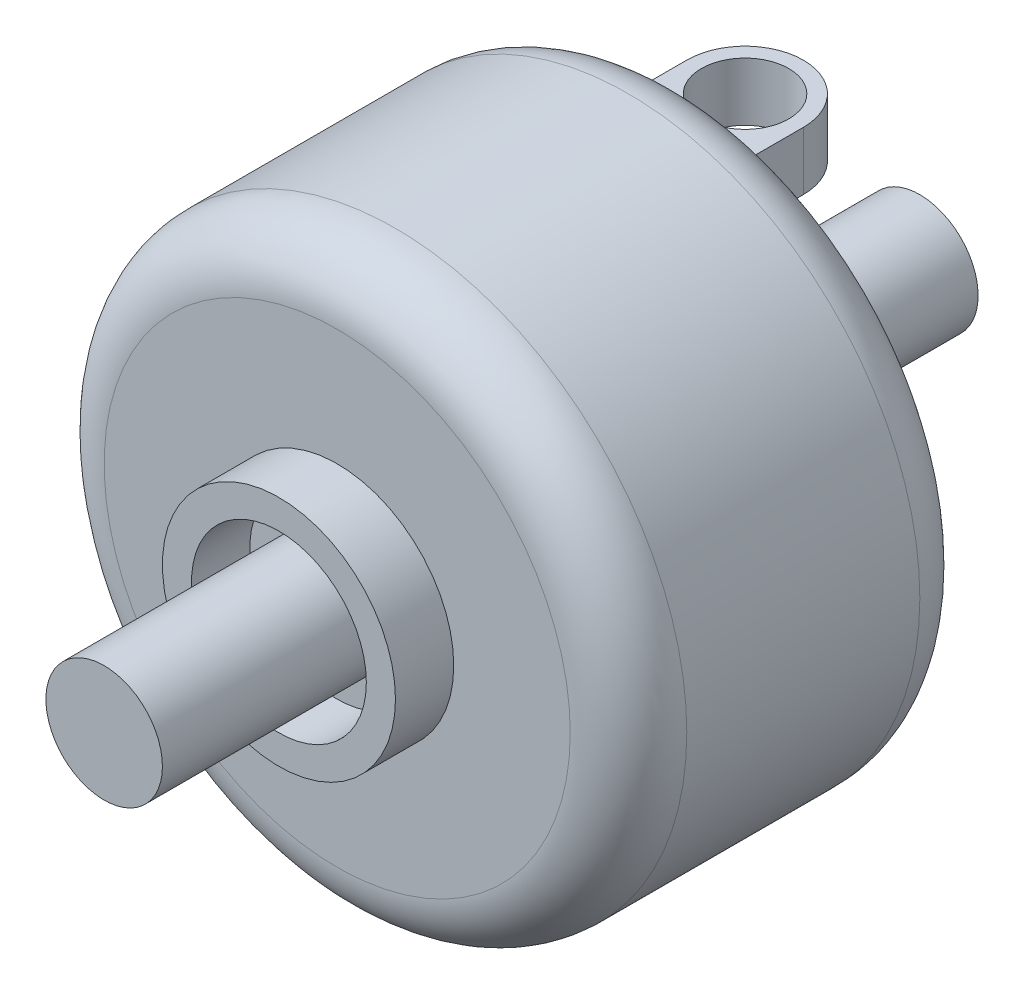
ISO-10303-21;
HEADER;
FILE_DESCRIPTION(('STEP AP214'),'2;1');
FILE_NAME('part.step','',(''),(''),'','','');
FILE_SCHEMA(('AUTOMOTIVE_DESIGN { 1 0 10303 214 1 1 1 1 }'));
ENDSEC;
DATA;
#1=APPLICATION_CONTEXT('core data for automotive mechanical design processes');
#2=APPLICATION_PROTOCOL_DEFINITION('international standard','automotive_design',2000,#1);
#3=PRODUCT_CONTEXT('',#1,'mechanical');
#4=PRODUCT('Part','Part','',(#3));
#5=PRODUCT_RELATED_PRODUCT_CATEGORY('part','',(#4));
#6=PRODUCT_DEFINITION_FORMATION('','',#4);
#7=PRODUCT_DEFINITION_CONTEXT('part definition',#1,'design');
#8=PRODUCT_DEFINITION('design','',#6,#7);
#9=PRODUCT_DEFINITION_SHAPE('','',#8);
#10=(LENGTH_UNIT() NAMED_UNIT(*) SI_UNIT(.MILLI.,.METRE.));
#11=(NAMED_UNIT(*) PLANE_ANGLE_UNIT() SI_UNIT($,.RADIAN.));
#12=(NAMED_UNIT(*) SI_UNIT($,.STERADIAN.) SOLID_ANGLE_UNIT());
#13=UNCERTAINTY_MEASURE_WITH_UNIT(LENGTH_MEASURE(1.E-05),#10,'distance_accuracy_value','');
#14=(GEOMETRIC_REPRESENTATION_CONTEXT(3) GLOBAL_UNCERTAINTY_ASSIGNED_CONTEXT((#13)) GLOBAL_UNIT_ASSIGNED_CONTEXT((#10,
#11,#12)) REPRESENTATION_CONTEXT('',''));
#15=CARTESIAN_POINT('',(0.,0.,0.));
#16=DIRECTION('',(0.,0.,1.));
#17=DIRECTION('',(1.,0.,0.));
#18=AXIS2_PLACEMENT_3D('',#15,#16,#17);
#19=CARTESIAN_POINT('',(0.,0.,50.));
#20=DIRECTION('',(0.,0.,-1.));
#21=DIRECTION('',(-1.,0.,0.));
#22=AXIS2_PLACEMENT_3D('',#19,#20,#21);
#23=CYLINDRICAL_SURFACE('',#22,10.);
#24=CARTESIAN_POINT('',(0.,0.,30.));
#25=DIRECTION('',(0.,0.,1.));
#26=DIRECTION('',(1.,0.,0.));
#27=AXIS2_PLACEMENT_3D('',#24,#25,#26);
#28=CIRCLE('',#27,10.);
#29=CARTESIAN_POINT('',(10.,0.,30.));
#30=VERTEX_POINT('',#29);
#31=EDGE_CURVE('E187',#30,#30,#28,.T.);
#32=ORIENTED_EDGE('',*,*,#31,.T.);
#33=EDGE_LOOP('',(#32));
#34=FACE_BOUND('',#33,.T.);
#35=CARTESIAN_POINT('',(0.,0.,35.));
#36=DIRECTION('',(0.,0.,1.));
#37=DIRECTION('',(1.,0.,0.));
#38=AXIS2_PLACEMENT_3D('',#35,#36,#37);
#39=CIRCLE('',#38,10.);
#40=CARTESIAN_POINT('',(10.,0.,35.));
#41=VERTEX_POINT('',#40);
#42=EDGE_CURVE('E421',#41,#41,#39,.T.);
#43=ORIENTED_EDGE('',*,*,#42,.F.);
#44=EDGE_LOOP('',(#43));
#45=FACE_BOUND('',#44,.T.);
#46=ADVANCED_FACE('F41',(#34,#45),#23,.T.);
#47=CARTESIAN_POINT('',(0.,0.,0.));
#48=DIRECTION('',(0.,0.,1.));
#49=DIRECTION('',(1.,0.,0.));
#50=AXIS2_PLACEMENT_3D('',#47,#48,#49);
#51=PLANE('',#50);
#52=DIRECTION('',(0.,1.,0.));
#53=VECTOR('',#52,1.);
#54=CARTESIAN_POINT('',(-5.,-20.,0.));
#55=LINE('',#54,#53);
#56=CARTESIAN_POINT('',(-5.,-19.3649167310371,0.));
#57=VERTEX_POINT('',#56);
#58=CARTESIAN_POINT('',(-5.,-15.,0.));
#59=VERTEX_POINT('',#58);
#60=EDGE_CURVE('E441',#57,#59,#55,.T.);
#61=ORIENTED_EDGE('',*,*,#60,.F.);
#62=CARTESIAN_POINT('',(0.,0.,0.));
#63=DIRECTION('',(0.,0.,1.));
#64=DIRECTION('',(1.,0.,0.));
#65=AXIS2_PLACEMENT_3D('',#62,#63,#64);
#66=CIRCLE('',#65,20.);
#67=CARTESIAN_POINT('',(-5.,19.3649167310371,0.));
#68=VERTEX_POINT('',#67);
#69=EDGE_CURVE('E156',#57,#68,#66,.F.);
#70=ORIENTED_EDGE('',*,*,#69,.T.);
#71=DIRECTION('',(0.,1.,0.));
#72=VECTOR('',#71,1.);
#73=CARTESIAN_POINT('',(-5.,15.,0.));
#74=LINE('',#73,#72);
#75=CARTESIAN_POINT('',(-5.,15.,0.));
#76=VERTEX_POINT('',#75);
#77=EDGE_CURVE('E139',#76,#68,#74,.T.);
#78=ORIENTED_EDGE('',*,*,#77,.F.);
#79=DIRECTION('',(-1.,0.,0.));
#80=VECTOR('',#79,1.);
#81=CARTESIAN_POINT('',(-5.,15.,0.));
#82=LINE('',#81,#80);
#83=CARTESIAN_POINT('',(5.,15.,0.));
#84=VERTEX_POINT('',#83);
#85=EDGE_CURVE('E146',#84,#76,#82,.T.);
#86=ORIENTED_EDGE('',*,*,#85,.F.);
#87=DIRECTION('',(0.,-1.,0.));
#88=VECTOR('',#87,1.);
#89=CARTESIAN_POINT('',(5.,15.,0.));
#90=LINE('',#89,#88);
#91=CARTESIAN_POINT('',(5.,19.3649167310371,0.));
#92=VERTEX_POINT('',#91);
#93=EDGE_CURVE('E158',#92,#84,#90,.T.);
#94=ORIENTED_EDGE('',*,*,#93,.F.);
#95=CARTESIAN_POINT('',(0.,0.,0.));
#96=DIRECTION('',(0.,0.,1.));
#97=DIRECTION('',(1.,0.,0.));
#98=AXIS2_PLACEMENT_3D('',#95,#96,#97);
#99=CIRCLE('',#98,20.);
#100=CARTESIAN_POINT('',(5.,-19.3649167310371,0.));
#101=VERTEX_POINT('',#100);
#102=EDGE_CURVE('E213',#92,#101,#99,.F.);
#103=ORIENTED_EDGE('',*,*,#102,.T.);
#104=DIRECTION('',(0.,-1.,0.));
#105=VECTOR('',#104,1.);
#106=CARTESIAN_POINT('',(5.,-20.,0.));
#107=LINE('',#106,#105);
#108=CARTESIAN_POINT('',(5.,-15.,0.));
#109=VERTEX_POINT('',#108);
#110=EDGE_CURVE('E449',#109,#101,#107,.T.);
#111=ORIENTED_EDGE('',*,*,#110,.F.);
#112=DIRECTION('',(1.,0.,0.));
#113=VECTOR('',#112,1.);
#114=CARTESIAN_POINT('',(-5.,-15.,0.));
#115=LINE('',#114,#113);
#116=EDGE_CURVE('E445',#59,#109,#115,.T.);
#117=ORIENTED_EDGE('',*,*,#116,.F.);
#118=EDGE_LOOP('',(#61,#70,#78,#86,#94,#103,#111,#117));
#119=FACE_BOUND('',#118,.T.);
#120=CARTESIAN_POINT('',(0.,0.,0.));
#121=DIRECTION('',(0.,0.,-1.));
#122=DIRECTION('',(-1.,0.,0.));
#123=AXIS2_PLACEMENT_3D('',#120,#121,#122);
#124=CIRCLE('',#123,10.);
#125=CARTESIAN_POINT('',(-10.,0.,0.));
#126=VERTEX_POINT('',#125);
#127=EDGE_CURVE('E182',#126,#126,#124,.T.);
#128=ORIENTED_EDGE('',*,*,#127,.F.);
#129=EDGE_LOOP('',(#128));
#130=FACE_BOUND('',#129,.T.);
#131=ADVANCED_FACE('F152',(#119,#130),#51,.F.);
#132=CARTESIAN_POINT('',(0.,0.,30.));
#133=DIRECTION('',(0.,0.,-1.));
#134=DIRECTION('',(-1.,0.,0.));
#135=AXIS2_PLACEMENT_3D('',#132,#133,#134);
#136=CYLINDRICAL_SURFACE('',#135,25.);
#137=CARTESIAN_POINT('',(0.,0.,25.));
#138=DIRECTION('',(0.,0.,1.));
#139=DIRECTION('',(1.,0.,0.));
#140=AXIS2_PLACEMENT_3D('',#137,#138,#139);
#141=CIRCLE('',#140,25.);
#142=CARTESIAN_POINT('',(25.,0.,25.));
#143=VERTEX_POINT('',#142);
#144=EDGE_CURVE('E209',#143,#143,#141,.F.);
#145=ORIENTED_EDGE('',*,*,#144,.T.);
#146=EDGE_LOOP('',(#145));
#147=FACE_BOUND('',#146,.T.);
#148=CARTESIAN_POINT('',(0.,0.,5.));
#149=DIRECTION('',(0.,0.,1.));
#150=DIRECTION('',(1.,0.,0.));
#151=AXIS2_PLACEMENT_3D('',#148,#149,#150);
#152=CIRCLE('',#151,25.);
#153=CARTESIAN_POINT('',(25.,0.,5.));
#154=VERTEX_POINT('',#153);
#155=EDGE_CURVE('E205',#154,#154,#152,.T.);
#156=ORIENTED_EDGE('',*,*,#155,.T.);
#157=EDGE_LOOP('',(#156));
#158=FACE_BOUND('',#157,.T.);
#159=ADVANCED_FACE('F339',(#147,#158),#136,.T.);
#160=CARTESIAN_POINT('',(0.,0.,30.));
#161=DIRECTION('',(0.,0.,1.));
#162=DIRECTION('',(1.,0.,0.));
#163=AXIS2_PLACEMENT_3D('',#160,#161,#162);
#164=PLANE('',#163);
#165=CARTESIAN_POINT('',(0.,0.,30.));
#166=DIRECTION('',(0.,0.,1.));
#167=DIRECTION('',(1.,0.,0.));
#168=AXIS2_PLACEMENT_3D('',#165,#166,#167);
#169=CIRCLE('',#168,20.);
#170=CARTESIAN_POINT('',(20.,0.,30.));
#171=VERTEX_POINT('',#170);
#172=EDGE_CURVE('E186',#171,#171,#169,.T.);
#173=ORIENTED_EDGE('',*,*,#172,.T.);
#174=EDGE_LOOP('',(#173));
#175=FACE_BOUND('',#174,.T.);
#176=ORIENTED_EDGE('',*,*,#31,.F.);
#177=EDGE_LOOP('',(#176));
#178=FACE_BOUND('',#177,.T.);
#179=ADVANCED_FACE('F346',(#175,#178),#164,.T.);
#180=CARTESIAN_POINT('',(0.,0.,-5.));
#181=DIRECTION('',(0.,0.,1.));
#182=DIRECTION('',(1.,0.,0.));
#183=AXIS2_PLACEMENT_3D('',#180,#181,#182);
#184=CYLINDRICAL_SURFACE('',#183,10.);
#185=CARTESIAN_POINT('',(0.,0.,-5.));
#186=DIRECTION('',(0.,0.,-1.));
#187=DIRECTION('',(-1.,0.,0.));
#188=AXIS2_PLACEMENT_3D('',#185,#186,#187);
#189=CIRCLE('',#188,10.);
#190=CARTESIAN_POINT('',(-10.,0.,-5.));
#191=VERTEX_POINT('',#190);
#192=EDGE_CURVE('E177',#191,#191,#189,.T.);
#193=ORIENTED_EDGE('',*,*,#192,.F.);
#194=EDGE_LOOP('',(#193));
#195=FACE_BOUND('',#194,.T.);
#196=ORIENTED_EDGE('',*,*,#127,.T.);
#197=EDGE_LOOP('',(#196));
#198=FACE_BOUND('',#197,.T.);
#199=ADVANCED_FACE('F348',(#195,#198),#184,.T.);
#200=CARTESIAN_POINT('',(0.,0.,-5.));
#201=DIRECTION('',(0.,0.,-1.));
#202=DIRECTION('',(-1.,0.,0.));
#203=AXIS2_PLACEMENT_3D('',#200,#201,#202);
#204=PLANE('',#203);
#205=CARTESIAN_POINT('',(0.,0.,-5.));
#206=DIRECTION('',(0.,0.,-1.));
#207=DIRECTION('',(-1.,0.,0.));
#208=AXIS2_PLACEMENT_3D('',#205,#206,#207);
#209=CIRCLE('',#208,7.5);
#210=CARTESIAN_POINT('',(-7.5,0.,-5.));
#211=VERTEX_POINT('',#210);
#212=EDGE_CURVE('E403',#211,#211,#209,.T.);
#213=ORIENTED_EDGE('',*,*,#212,.F.);
#214=EDGE_LOOP('',(#213));
#215=FACE_BOUND('',#214,.T.);
#216=ORIENTED_EDGE('',*,*,#192,.T.);
#217=EDGE_LOOP('',(#216));
#218=FACE_BOUND('',#217,.T.);
#219=ADVANCED_FACE('F331',(#215,#218),#204,.T.);
#220=CARTESIAN_POINT('',(-5.,15.,-10.));
#221=DIRECTION('',(1.,0.,0.));
#222=DIRECTION('',(0.,1.,0.));
#223=AXIS2_PLACEMENT_3D('',#220,#221,#222);
#224=PLANE('',#223);
#225=DIRECTION('',(0.,0.,1.));
#226=VECTOR('',#225,1.);
#227=CARTESIAN_POINT('',(-5.,20.,-10.));
#228=LINE('',#227,#226);
#229=CARTESIAN_POINT('',(-5.,20.,-5.));
#230=VERTEX_POINT('',#229);
#231=CARTESIAN_POINT('',(-5.,20.,0.0380321319528795));
#232=VERTEX_POINT('',#231);
#233=EDGE_CURVE('E174',#230,#232,#228,.T.);
#234=ORIENTED_EDGE('',*,*,#233,.F.);
#235=DIRECTION('',(0.,1.,0.));
#236=VECTOR('',#235,1.);
#237=CARTESIAN_POINT('',(-5.,15.,-5.));
#238=LINE('',#237,#236);
#239=CARTESIAN_POINT('',(-5.,15.,-5.));
#240=VERTEX_POINT('',#239);
#241=EDGE_CURVE('E11',#230,#240,#238,.F.);
#242=ORIENTED_EDGE('',*,*,#241,.T.);
#243=DIRECTION('',(0.,0.,1.));
#244=VECTOR('',#243,1.);
#245=CARTESIAN_POINT('',(-5.,15.,-10.));
#246=LINE('',#245,#244);
#247=EDGE_CURVE('E135',#240,#76,#246,.T.);
#248=ORIENTED_EDGE('',*,*,#247,.T.);
#249=ORIENTED_EDGE('',*,*,#77,.T.);
#250=CARTESIAN_POINT('',(-5.,19.3649167310371,0.));
#251=CARTESIAN_POINT('',(-5.,19.4711435408004,-1.59857103890314E-06));
#252=CARTESIAN_POINT('',(-5.,19.5771805060712,0.00316694102008982));
#253=CARTESIAN_POINT('',(-5.,19.788874929712,0.0158443074308182));
#254=CARTESIAN_POINT('',(-5.,19.8945323874288,0.025353145157313));
#255=CARTESIAN_POINT('',(-5.,20.,0.0380321319528704));
#256=B_SPLINE_CURVE_WITH_KNOTS('',3,(#250,#251,#252,#253,#254,#255),.UNSPECIFIED.,.F.,.F.,(4,2,
4),(0.,0.318252885019034,0.636506317513864),.UNSPECIFIED.);
#257=EDGE_CURVE('E218',#68,#232,#256,.T.);
#258=ORIENTED_EDGE('',*,*,#257,.T.);
#259=EDGE_LOOP('',(#234,#242,#248,#249,#258));
#260=FACE_BOUND('',#259,.T.);
#261=ADVANCED_FACE('F137',(#260),#224,.F.);
#262=CARTESIAN_POINT('',(-5.,20.,-10.));
#263=DIRECTION('',(0.,-1.,0.));
#264=DIRECTION('',(1.,0.,0.));
#265=AXIS2_PLACEMENT_3D('',#262,#263,#264);
#266=PLANE('',#265);
#267=CARTESIAN_POINT('',(0.,20.,-5.));
#268=DIRECTION('',(0.,1.,0.));
#269=DIRECTION('',(-1.,0.,0.));
#270=AXIS2_PLACEMENT_3D('',#267,#268,#269);
#271=CIRCLE('',#270,3.75);
#272=CARTESIAN_POINT('',(-3.74999999999999,20.,-5.));
#273=VERTEX_POINT('',#272);
#274=EDGE_CURVE('E433',#273,#273,#271,.T.);
#275=ORIENTED_EDGE('',*,*,#274,.F.);
#276=EDGE_LOOP('',(#275));
#277=FACE_BOUND('',#276,.T.);
#278=DIRECTION('',(0.,0.,1.));
#279=VECTOR('',#278,1.);
#280=CARTESIAN_POINT('',(5.,20.,-10.));
#281=LINE('',#280,#279);
#282=CARTESIAN_POINT('',(5.,20.,-5.));
#283=VERTEX_POINT('',#282);
#284=CARTESIAN_POINT('',(5.,20.,0.0380321319528778));
#285=VERTEX_POINT('',#284);
#286=EDGE_CURVE('E171',#283,#285,#281,.T.);
#287=ORIENTED_EDGE('',*,*,#286,.F.);
#288=CARTESIAN_POINT('',(0.,20.,-5.));
#289=DIRECTION('',(0.,-1.,0.));
#290=DIRECTION('',(1.,0.,0.));
#291=AXIS2_PLACEMENT_3D('',#288,#289,#290);
#292=CIRCLE('',#291,5.);
#293=CARTESIAN_POINT('',(0.,20.,-10.));
#294=VERTEX_POINT('',#293);
#295=EDGE_CURVE('E51',#283,#294,#292,.F.);
#296=ORIENTED_EDGE('',*,*,#295,.T.);
#297=CARTESIAN_POINT('',(0.,20.,-5.));
#298=DIRECTION('',(0.,-1.,0.));
#299=DIRECTION('',(1.,0.,0.));
#300=AXIS2_PLACEMENT_3D('',#297,#298,#299);
#301=CIRCLE('',#300,5.);
#302=EDGE_CURVE('E59',#294,#230,#301,.F.);
#303=ORIENTED_EDGE('',*,*,#302,.T.);
#304=ORIENTED_EDGE('',*,*,#233,.T.);
#305=CARTESIAN_POINT('',(-5.,20.,0.0380321319528789));
#306=CARTESIAN_POINT('',(-4.79172627708819,20.,0.0317770860692456));
#307=CARTESIAN_POINT('',(-4.58342331012892,20.,0.0266509781953639));
#308=CARTESIAN_POINT('',(-4.16678753030685,20.,0.0181852564625262));
#309=CARTESIAN_POINT('',(-3.95845471870868,20.,0.0148455815006976));
#310=CARTESIAN_POINT('',(-3.54178342100838,20.,0.00948110610459965));
#311=CARTESIAN_POINT('',(-3.33344493563177,20.,0.00745624395064969));
#312=CARTESIAN_POINT('',(-2.91675939888512,20.,0.00432982564868455));
#313=CARTESIAN_POINT('',(-2.70841234745178,20.,0.00322827841668376));
#314=CARTESIAN_POINT('',(-2.29173129729011,20.,0.00161848481480243));
#315=CARTESIAN_POINT('',(-2.08339729870398,20.,0.00111019566597089));
#316=CARTESIAN_POINT('',(-1.66672960605639,20.,0.000428330578891939));
#317=CARTESIAN_POINT('',(-1.45839591199652,20.,0.000254753442649956));
#318=CARTESIAN_POINT('',(-1.04171872902487,20.,4.98880398136789E-05));
#319=CARTESIAN_POINT('',(-0.833375240111585,20.,1.86064411764695E-05));
#320=CARTESIAN_POINT('',(-0.41668783052716,20.,4.61610223762926E-07));
#321=CARTESIAN_POINT('',(-0.208343909856013,20.,1.35984688042701E-05));
#322=CARTESIAN_POINT('',(0.,20.,0.));
#323=B_SPLINE_CURVE_WITH_KNOTS('',3,(#305,#306,#307,#308,#309,#310,#311,#312,#313,#314,#315,
#316,#317,#318,#319,#320,#321,#322),.UNSPECIFIED.,.F.,.F.,(4,2,2,2,2,2,2,2,4),(0.,
0.625093183831321,1.25016498570549,1.87520744346218,2.50025593688797,3.12525935621882,
3.75026053854571,4.37529100807446,5.00032275663922),.UNSPECIFIED.);
#324=CARTESIAN_POINT('',(0.,20.,0.));
#325=VERTEX_POINT('',#324);
#326=EDGE_CURVE('E227',#232,#325,#323,.T.);
#327=ORIENTED_EDGE('',*,*,#326,.T.);
#328=CARTESIAN_POINT('',(0.,20.,0.));
#329=CARTESIAN_POINT('',(0.208343909856026,20.,1.35984688049139E-05));
#330=CARTESIAN_POINT('',(0.416687830527172,20.,4.61610224618808E-07));
#331=CARTESIAN_POINT('',(0.833375240111596,20.,1.86064411769823E-05));
#332=CARTESIAN_POINT('',(1.04171872902488,20.,4.98880398136365E-05));
#333=CARTESIAN_POINT('',(1.45839591199653,20.,0.000254753442649378));
#334=CARTESIAN_POINT('',(1.6667296060564,20.,0.000428330578891381));
#335=CARTESIAN_POINT('',(2.08339729870398,20.,0.00111019566597043));
#336=CARTESIAN_POINT('',(2.29173129729012,20.,0.00161848481480206));
#337=CARTESIAN_POINT('',(2.70841234745178,20.,0.00322827841668329));
#338=CARTESIAN_POINT('',(2.91675939888512,20.,0.0043298256486839));
#339=CARTESIAN_POINT('',(3.33344493563178,20.,0.00745624395064911));
#340=CARTESIAN_POINT('',(3.54178342100838,20.,0.00948110610459933));
#341=CARTESIAN_POINT('',(3.95845471870868,20.,0.014845581500698));
#342=CARTESIAN_POINT('',(4.16678753030685,20.,0.0181852564625271));
#343=CARTESIAN_POINT('',(4.58342331012892,20.,0.0266509781953627));
#344=CARTESIAN_POINT('',(4.79172627708819,20.,0.0317770860692421));
#345=CARTESIAN_POINT('',(5.,20.,0.03803213195287));
#346=B_SPLINE_CURVE_WITH_KNOTS('',3,(#328,#329,#330,#331,#332,#333,#334,#335,#336,#337,#338,
#339,#340,#341,#342,#343,#344,#345),.UNSPECIFIED.,.F.,.F.,(4,2,2,2,2,2,2,2,4),(0.,
0.625031748564763,1.25006221809351,1.8750634004204,2.50006681975125,3.12511531317704,
3.75015777093372,4.37522957280789,5.00032275663921),.UNSPECIFIED.);
#347=EDGE_CURVE('E253',#325,#285,#346,.T.);
#348=ORIENTED_EDGE('',*,*,#347,.T.);
#349=EDGE_LOOP('',(#287,#296,#303,#304,#327,#348));
#350=FACE_BOUND('',#349,.T.);
#351=ADVANCED_FACE('F322',(#277,#350),#266,.F.);
#352=CARTESIAN_POINT('',(5.,15.,-10.));
#353=DIRECTION('',(-1.,0.,0.));
#354=DIRECTION('',(0.,-1.,0.));
#355=AXIS2_PLACEMENT_3D('',#352,#353,#354);
#356=PLANE('',#355);
#357=DIRECTION('',(0.,0.,1.));
#358=VECTOR('',#357,1.);
#359=CARTESIAN_POINT('',(5.,15.,-10.));
#360=LINE('',#359,#358);
#361=CARTESIAN_POINT('',(5.,15.,-5.));
#362=VERTEX_POINT('',#361);
#363=EDGE_CURVE('E145',#362,#84,#360,.T.);
#364=ORIENTED_EDGE('',*,*,#363,.F.);
#365=DIRECTION('',(0.,-1.,0.));
#366=VECTOR('',#365,1.);
#367=CARTESIAN_POINT('',(5.,20.,-5.));
#368=LINE('',#367,#366);
#369=EDGE_CURVE('E499',#362,#283,#368,.F.);
#370=ORIENTED_EDGE('',*,*,#369,.T.);
#371=ORIENTED_EDGE('',*,*,#286,.T.);
#372=CARTESIAN_POINT('',(5.,20.,0.038032131952878));
#373=CARTESIAN_POINT('',(5.,19.8945323874288,0.025353145157317));
#374=CARTESIAN_POINT('',(5.,19.788874929712,0.0158443074308195));
#375=CARTESIAN_POINT('',(5.,19.5771805060712,0.00316694102008734));
#376=CARTESIAN_POINT('',(5.,19.4711435408004,-1.59857104240746E-06));
#377=CARTESIAN_POINT('',(5.,19.3649167310371,0.));
#378=B_SPLINE_CURVE_WITH_KNOTS('',3,(#372,#373,#374,#375,#376,#377),.UNSPECIFIED.,.F.,.F.,(4,2,
4),(0.,0.318253432494831,0.636506317513862),.UNSPECIFIED.);
#379=EDGE_CURVE('E260',#285,#92,#378,.T.);
#380=ORIENTED_EDGE('',*,*,#379,.T.);
#381=ORIENTED_EDGE('',*,*,#93,.T.);
#382=EDGE_LOOP('',(#364,#370,#371,#380,#381));
#383=FACE_BOUND('',#382,.T.);
#384=ADVANCED_FACE('F318',(#383),#356,.F.);
#385=CARTESIAN_POINT('',(-5.,15.,-10.));
#386=DIRECTION('',(0.,1.,0.));
#387=DIRECTION('',(0.,0.,1.));
#388=AXIS2_PLACEMENT_3D('',#385,#386,#387);
#389=PLANE('',#388);
#390=CARTESIAN_POINT('',(0.,15.,-5.));
#391=DIRECTION('',(0.,1.,0.));
#392=DIRECTION('',(0.,0.,1.));
#393=AXIS2_PLACEMENT_3D('',#390,#391,#392);
#394=CIRCLE('',#393,3.75);
#395=CARTESIAN_POINT('',(0.,15.,-1.25));
#396=VERTEX_POINT('',#395);
#397=EDGE_CURVE('E437',#396,#396,#394,.F.);
#398=ORIENTED_EDGE('',*,*,#397,.F.);
#399=EDGE_LOOP('',(#398));
#400=FACE_BOUND('',#399,.T.);
#401=CARTESIAN_POINT('',(0.,15.,-5.));
#402=DIRECTION('',(0.,1.,0.));
#403=DIRECTION('',(0.,0.,1.));
#404=AXIS2_PLACEMENT_3D('',#401,#402,#403);
#405=CIRCLE('',#404,5.);
#406=CARTESIAN_POINT('',(0.,15.,-10.));
#407=VERTEX_POINT('',#406);
#408=EDGE_CURVE('E491',#240,#407,#405,.F.);
#409=ORIENTED_EDGE('',*,*,#408,.T.);
#410=CARTESIAN_POINT('',(0.,15.,-5.));
#411=DIRECTION('',(0.,1.,0.));
#412=DIRECTION('',(0.,0.,1.));
#413=AXIS2_PLACEMENT_3D('',#410,#411,#412);
#414=CIRCLE('',#413,5.);
#415=EDGE_CURVE('E494',#407,#362,#414,.F.);
#416=ORIENTED_EDGE('',*,*,#415,.T.);
#417=ORIENTED_EDGE('',*,*,#363,.T.);
#418=ORIENTED_EDGE('',*,*,#85,.T.);
#419=ORIENTED_EDGE('',*,*,#247,.F.);
#420=EDGE_LOOP('',(#409,#416,#417,#418,#419));
#421=FACE_BOUND('',#420,.T.);
#422=ADVANCED_FACE('F161',(#400,#421),#389,.F.);
#423=CARTESIAN_POINT('',(-5.,-20.,-10.));
#424=DIRECTION('',(1.,0.,0.));
#425=DIRECTION('',(0.,1.,0.));
#426=AXIS2_PLACEMENT_3D('',#423,#424,#425);
#427=PLANE('',#426);
#428=DIRECTION('',(0.,0.,1.));
#429=VECTOR('',#428,1.);
#430=CARTESIAN_POINT('',(-5.,-15.,-10.));
#431=LINE('',#430,#429);
#432=CARTESIAN_POINT('',(-5.,-15.,-5.));
#433=VERTEX_POINT('',#432);
#434=EDGE_CURVE('E159',#433,#59,#431,.T.);
#435=ORIENTED_EDGE('',*,*,#434,.F.);
#436=DIRECTION('',(0.,1.,0.));
#437=VECTOR('',#436,1.);
#438=CARTESIAN_POINT('',(-5.,-20.,-5.));
#439=LINE('',#438,#437);
#440=CARTESIAN_POINT('',(-5.,-20.,-5.));
#441=VERTEX_POINT('',#440);
#442=EDGE_CURVE('E495',#433,#441,#439,.F.);
#443=ORIENTED_EDGE('',*,*,#442,.T.);
#444=DIRECTION('',(0.,0.,1.));
#445=VECTOR('',#444,1.);
#446=CARTESIAN_POINT('',(-5.,-20.,-10.));
#447=LINE('',#446,#445);
#448=CARTESIAN_POINT('',(-5.,-20.,0.0380321319528795));
#449=VERTEX_POINT('',#448);
#450=EDGE_CURVE('E453',#441,#449,#447,.T.);
#451=ORIENTED_EDGE('',*,*,#450,.T.);
#452=CARTESIAN_POINT('',(-5.,-20.,0.0380321319528789));
#453=CARTESIAN_POINT('',(-5.,-19.8945323874288,0.0253531451573182));
#454=CARTESIAN_POINT('',(-5.,-19.788874929712,0.0158443074308208));
#455=CARTESIAN_POINT('',(-5.,-19.5771805060712,0.00316694102008812));
#456=CARTESIAN_POINT('',(-5.,-19.4711435408004,-1.59857104212891E-06));
#457=CARTESIAN_POINT('',(-5.,-19.3649167310371,0.));
#458=B_SPLINE_CURVE_WITH_KNOTS('',3,(#452,#453,#454,#455,#456,#457),.UNSPECIFIED.,.F.,.F.,(4,2,
4),(0.,0.318253432494831,0.636506317513865),.UNSPECIFIED.);
#459=EDGE_CURVE('E289',#449,#57,#458,.T.);
#460=ORIENTED_EDGE('',*,*,#459,.T.);
#461=ORIENTED_EDGE('',*,*,#60,.T.);
#462=EDGE_LOOP('',(#435,#443,#451,#460,#461));
#463=FACE_BOUND('',#462,.T.);
#464=ADVANCED_FACE('F311',(#463),#427,.F.);
#465=CARTESIAN_POINT('',(-5.,-15.,-10.));
#466=DIRECTION('',(0.,-1.,0.));
#467=DIRECTION('',(0.,0.,-1.));
#468=AXIS2_PLACEMENT_3D('',#465,#466,#467);
#469=PLANE('',#468);
#470=CARTESIAN_POINT('',(0.,-15.,-5.));
#471=DIRECTION('',(0.,-1.,0.));
#472=DIRECTION('',(0.,0.,-1.));
#473=AXIS2_PLACEMENT_3D('',#470,#471,#472);
#474=CIRCLE('',#473,3.75);
#475=CARTESIAN_POINT('',(0.,-15.,-8.75));
#476=VERTEX_POINT('',#475);
#477=EDGE_CURVE('E429',#476,#476,#474,.F.);
#478=ORIENTED_EDGE('',*,*,#477,.F.);
#479=EDGE_LOOP('',(#478));
#480=FACE_BOUND('',#479,.T.);
#481=DIRECTION('',(0.,0.,1.));
#482=VECTOR('',#481,1.);
#483=CARTESIAN_POINT('',(5.,-15.,-10.));
#484=LINE('',#483,#482);
#485=CARTESIAN_POINT('',(5.,-15.,-5.));
#486=VERTEX_POINT('',#485);
#487=EDGE_CURVE('E459',#486,#109,#484,.T.);
#488=ORIENTED_EDGE('',*,*,#487,.F.);
#489=CARTESIAN_POINT('',(0.,-15.,-5.));
#490=DIRECTION('',(0.,-1.,0.));
#491=DIRECTION('',(0.,0.,-1.));
#492=AXIS2_PLACEMENT_3D('',#489,#490,#491);
#493=CIRCLE('',#492,5.);
#494=CARTESIAN_POINT('',(0.,-15.,-10.));
#495=VERTEX_POINT('',#494);
#496=EDGE_CURVE('E501',#486,#495,#493,.F.);
#497=ORIENTED_EDGE('',*,*,#496,.T.);
#498=CARTESIAN_POINT('',(0.,-15.,-5.));
#499=DIRECTION('',(0.,-1.,0.));
#500=DIRECTION('',(0.,0.,-1.));
#501=AXIS2_PLACEMENT_3D('',#498,#499,#500);
#502=CIRCLE('',#501,5.);
#503=EDGE_CURVE('E468',#495,#433,#502,.F.);
#504=ORIENTED_EDGE('',*,*,#503,.T.);
#505=ORIENTED_EDGE('',*,*,#434,.T.);
#506=ORIENTED_EDGE('',*,*,#116,.T.);
#507=EDGE_LOOP('',(#488,#497,#504,#505,#506));
#508=FACE_BOUND('',#507,.T.);
#509=ADVANCED_FACE('F308',(#480,#508),#469,.F.);
#510=CARTESIAN_POINT('',(5.,-20.,-10.));
#511=DIRECTION('',(-1.,0.,0.));
#512=DIRECTION('',(0.,-1.,0.));
#513=AXIS2_PLACEMENT_3D('',#510,#511,#512);
#514=PLANE('',#513);
#515=DIRECTION('',(0.,0.,1.));
#516=VECTOR('',#515,1.);
#517=CARTESIAN_POINT('',(5.,-20.,-10.));
#518=LINE('',#517,#516);
#519=CARTESIAN_POINT('',(5.,-20.,-5.));
#520=VERTEX_POINT('',#519);
#521=CARTESIAN_POINT('',(5.,-20.,0.0380321319528795));
#522=VERTEX_POINT('',#521);
#523=EDGE_CURVE('E456',#520,#522,#518,.T.);
#524=ORIENTED_EDGE('',*,*,#523,.F.);
#525=DIRECTION('',(0.,-1.,0.));
#526=VECTOR('',#525,1.);
#527=CARTESIAN_POINT('',(5.,-15.,-5.));
#528=LINE('',#527,#526);
#529=EDGE_CURVE('E536',#520,#486,#528,.F.);
#530=ORIENTED_EDGE('',*,*,#529,.T.);
#531=ORIENTED_EDGE('',*,*,#487,.T.);
#532=ORIENTED_EDGE('',*,*,#110,.T.);
#533=CARTESIAN_POINT('',(5.,-19.3649167310371,0.));
#534=CARTESIAN_POINT('',(5.,-19.4711435408004,-1.59857103890314E-06));
#535=CARTESIAN_POINT('',(5.,-19.5771805060712,0.00316694102008982));
#536=CARTESIAN_POINT('',(5.,-19.788874929712,0.0158443074308182));
#537=CARTESIAN_POINT('',(5.,-19.8945323874288,0.025353145157313));
#538=CARTESIAN_POINT('',(5.,-20.,0.0380321319528704));
#539=B_SPLINE_CURVE_WITH_KNOTS('',3,(#533,#534,#535,#536,#537,#538),.UNSPECIFIED.,.F.,.F.,(4,2,
4),(0.,0.318252885019034,0.636506317513864),.UNSPECIFIED.);
#540=EDGE_CURVE('E268',#101,#522,#539,.T.);
#541=ORIENTED_EDGE('',*,*,#540,.T.);
#542=EDGE_LOOP('',(#524,#530,#531,#532,#541));
#543=FACE_BOUND('',#542,.T.);
#544=ADVANCED_FACE('F301',(#543),#514,.F.);
#545=CARTESIAN_POINT('',(-5.,-20.,-10.));
#546=DIRECTION('',(0.,1.,0.));
#547=DIRECTION('',(0.,0.,1.));
#548=AXIS2_PLACEMENT_3D('',#545,#546,#547);
#549=PLANE('',#548);
#550=CARTESIAN_POINT('',(0.,-20.,-5.));
#551=DIRECTION('',(0.,-1.,0.));
#552=DIRECTION('',(0.,0.,-1.));
#553=AXIS2_PLACEMENT_3D('',#550,#551,#552);
#554=CIRCLE('',#553,3.75);
#555=CARTESIAN_POINT('',(0.,-20.,-8.75));
#556=VERTEX_POINT('',#555);
#557=EDGE_CURVE('E425',#556,#556,#554,.T.);
#558=ORIENTED_EDGE('',*,*,#557,.F.);
#559=EDGE_LOOP('',(#558));
#560=FACE_BOUND('',#559,.T.);
#561=CARTESIAN_POINT('',(0.,-20.,-5.));
#562=DIRECTION('',(0.,1.,0.));
#563=DIRECTION('',(0.,0.,1.));
#564=AXIS2_PLACEMENT_3D('',#561,#562,#563);
#565=CIRCLE('',#564,5.);
#566=CARTESIAN_POINT('',(0.,-20.,-10.));
#567=VERTEX_POINT('',#566);
#568=EDGE_CURVE('E529',#441,#567,#565,.F.);
#569=ORIENTED_EDGE('',*,*,#568,.T.);
#570=CARTESIAN_POINT('',(0.,-20.,-5.));
#571=DIRECTION('',(0.,1.,0.));
#572=DIRECTION('',(0.,0.,1.));
#573=AXIS2_PLACEMENT_3D('',#570,#571,#572);
#574=CIRCLE('',#573,5.);
#575=EDGE_CURVE('E534',#567,#520,#574,.F.);
#576=ORIENTED_EDGE('',*,*,#575,.T.);
#577=ORIENTED_EDGE('',*,*,#523,.T.);
#578=CARTESIAN_POINT('',(5.,-20.,0.0380321319528789));
#579=CARTESIAN_POINT('',(4.79172627708819,-20.,0.0317770860692447));
#580=CARTESIAN_POINT('',(4.58342331012892,-20.,0.026650978195363));
#581=CARTESIAN_POINT('',(4.16678753030685,-20.,0.0181852564625259));
#582=CARTESIAN_POINT('',(3.95845471870868,-20.,0.0148455815006978));
#583=CARTESIAN_POINT('',(3.54178342100838,-20.,0.0094811061046001));
#584=CARTESIAN_POINT('',(3.33344493563177,-20.,0.00745624395064981));
#585=CARTESIAN_POINT('',(2.91675939888512,-20.,0.00432982564868401));
#586=CARTESIAN_POINT('',(2.70841234745178,-20.,0.00322827841668288));
#587=CARTESIAN_POINT('',(2.29173129729012,-20.,0.00161848481480187));
#588=CARTESIAN_POINT('',(2.08339729870398,-20.,0.00111019566597097));
#589=CARTESIAN_POINT('',(1.66672960605639,-20.,0.000428330578892157));
#590=CARTESIAN_POINT('',(1.45839591199652,-20.,0.000254753442649663));
#591=CARTESIAN_POINT('',(1.04171872902488,-20.,4.98880398131644E-05));
#592=CARTESIAN_POINT('',(0.833375240111591,-20.,1.86064411762441E-05));
#593=CARTESIAN_POINT('',(0.416687830527166,-20.,4.61610224084615E-07));
#594=CARTESIAN_POINT('',(0.20834390985602,-20.,1.35984688048497E-05));
#595=CARTESIAN_POINT('',(0.,-20.,0.));
#596=B_SPLINE_CURVE_WITH_KNOTS('',3,(#578,#579,#580,#581,#582,#583,#584,#585,#586,#587,#588,
#589,#590,#591,#592,#593,#594,#595),.UNSPECIFIED.,.F.,.F.,(4,2,2,2,2,2,2,2,4),(0.,
0.62509318383132,1.25016498570549,1.87520744346218,2.50025593688796,3.12525935621882,
3.75026053854571,4.37529100807445,5.00032275663922),.UNSPECIFIED.);
#597=CARTESIAN_POINT('',(0.,-20.,0.));
#598=VERTEX_POINT('',#597);
#599=EDGE_CURVE('E275',#522,#598,#596,.T.);
#600=ORIENTED_EDGE('',*,*,#599,.T.);
#601=CARTESIAN_POINT('',(0.,-20.,0.));
#602=CARTESIAN_POINT('',(-0.208343909856019,-20.,1.35984688039373E-05));
#603=CARTESIAN_POINT('',(-0.416687830527166,-20.,4.61610223582308E-07));
#604=CARTESIAN_POINT('',(-0.83337524011159,-20.,1.86064411764172E-05));
#605=CARTESIAN_POINT('',(-1.04171872902488,-20.,4.98880398136027E-05));
#606=CARTESIAN_POINT('',(-1.45839591199652,-20.,0.000254753442649758));
#607=CARTESIAN_POINT('',(-1.66672960605639,-20.,0.000428330578891642));
#608=CARTESIAN_POINT('',(-2.08339729870398,-20.,0.00111019566597071));
#609=CARTESIAN_POINT('',(-2.29173129729012,-20.,0.00161848481480247));
#610=CARTESIAN_POINT('',(-2.70841234745178,-20.,0.00322827841668366));
#611=CARTESIAN_POINT('',(-2.91675939888512,-20.,0.0043298256486841));
#612=CARTESIAN_POINT('',(-3.33344493563177,-20.,0.00745624395064946));
#613=CARTESIAN_POINT('',(-3.54178342100838,-20.,0.00948110610459999));
#614=CARTESIAN_POINT('',(-3.95845471870868,-20.,0.0148455815006985));
#615=CARTESIAN_POINT('',(-4.16678753030685,-20.,0.018185256462527));
#616=CARTESIAN_POINT('',(-4.58342331012892,-20.,0.0266509781953624));
#617=CARTESIAN_POINT('',(-4.79172627708819,-20.,0.0317770860692419));
#618=CARTESIAN_POINT('',(-5.,-20.,0.0380321319528709));
#619=B_SPLINE_CURVE_WITH_KNOTS('',3,(#601,#602,#603,#604,#605,#606,#607,#608,#609,#610,#611,
#612,#613,#614,#615,#616,#617,#618),.UNSPECIFIED.,.F.,.F.,(4,2,2,2,2,2,2,2,4),(0.,
0.625031748564764,1.25006221809351,1.8750634004204,2.50006681975126,3.12511531317704,
3.75015777093373,4.3752295728079,5.00032275663922),.UNSPECIFIED.);
#620=EDGE_CURVE('E282',#598,#449,#619,.T.);
#621=ORIENTED_EDGE('',*,*,#620,.T.);
#622=ORIENTED_EDGE('',*,*,#450,.F.);
#623=EDGE_LOOP('',(#569,#576,#577,#600,#621,#622));
#624=FACE_BOUND('',#623,.T.);
#625=ADVANCED_FACE('F296',(#560,#624),#549,.F.);
#626=CARTESIAN_POINT('',(0.,4.39339828220179,-5.));
#627=DIRECTION('',(0.,1.,0.));
#628=DIRECTION('',(-1.,0.,0.));
#629=AXIS2_PLACEMENT_3D('',#626,#627,#628);
#630=CYLINDRICAL_SURFACE('',#629,3.75);
#631=ORIENTED_EDGE('',*,*,#397,.T.);
#632=EDGE_LOOP('',(#631));
#633=FACE_BOUND('',#632,.T.);
#634=ORIENTED_EDGE('',*,*,#274,.T.);
#635=EDGE_LOOP('',(#634));
#636=FACE_BOUND('',#635,.T.);
#637=ADVANCED_FACE('F300',(#633,#636),#630,.F.);
#638=CARTESIAN_POINT('',(0.,-4.39339828220179,-5.));
#639=DIRECTION('',(0.,-1.,0.));
#640=DIRECTION('',(0.,0.,-1.));
#641=AXIS2_PLACEMENT_3D('',#638,#639,#640);
#642=CYLINDRICAL_SURFACE('',#641,3.75);
#643=ORIENTED_EDGE('',*,*,#477,.T.);
#644=EDGE_LOOP('',(#643));
#645=FACE_BOUND('',#644,.T.);
#646=ORIENTED_EDGE('',*,*,#557,.T.);
#647=EDGE_LOOP('',(#646));
#648=FACE_BOUND('',#647,.T.);
#649=ADVANCED_FACE('F361',(#645,#648),#642,.F.);
#650=CARTESIAN_POINT('',(0.,0.,25.));
#651=DIRECTION('',(0.,0.,1.));
#652=DIRECTION('',(1.,0.,0.));
#653=AXIS2_PLACEMENT_3D('',#650,#651,#652);
#654=TOROIDAL_SURFACE('',#653,20.,5.);
#655=ORIENTED_EDGE('',*,*,#144,.F.);
#656=EDGE_LOOP('',(#655));
#657=FACE_BOUND('',#656,.T.);
#658=ORIENTED_EDGE('',*,*,#172,.F.);
#659=EDGE_LOOP('',(#658));
#660=FACE_BOUND('',#659,.T.);
#661=ADVANCED_FACE('F242',(#657,#660),#654,.T.);
#662=CARTESIAN_POINT('',(0.,0.,5.));
#663=DIRECTION('',(0.,0.,1.));
#664=DIRECTION('',(1.,0.,0.));
#665=AXIS2_PLACEMENT_3D('',#662,#663,#664);
#666=TOROIDAL_SURFACE('',#665,20.,5.);
#667=ORIENTED_EDGE('',*,*,#257,.F.);
#668=ORIENTED_EDGE('',*,*,#69,.F.);
#669=ORIENTED_EDGE('',*,*,#459,.F.);
#670=ORIENTED_EDGE('',*,*,#620,.F.);
#671=ORIENTED_EDGE('',*,*,#599,.F.);
#672=ORIENTED_EDGE('',*,*,#540,.F.);
#673=ORIENTED_EDGE('',*,*,#102,.F.);
#674=ORIENTED_EDGE('',*,*,#379,.F.);
#675=ORIENTED_EDGE('',*,*,#347,.F.);
#676=ORIENTED_EDGE('',*,*,#326,.F.);
#677=EDGE_LOOP('',(#667,#668,#669,#670,#671,#672,#673,#674,#675,#676));
#678=FACE_BOUND('',#677,.T.);
#679=ORIENTED_EDGE('',*,*,#155,.F.);
#680=EDGE_LOOP('',(#679));
#681=FACE_BOUND('',#680,.T.);
#682=ADVANCED_FACE('F236',(#678,#681),#666,.T.);
#683=CARTESIAN_POINT('',(0.,0.,-5.));
#684=DIRECTION('',(0.,-1.,0.));
#685=DIRECTION('',(1.,0.,0.));
#686=AXIS2_PLACEMENT_3D('',#683,#684,#685);
#687=CYLINDRICAL_SURFACE('',#686,5.);
#688=ORIENTED_EDGE('',*,*,#442,.F.);
#689=ORIENTED_EDGE('',*,*,#503,.F.);
#690=DIRECTION('',(0.,1.,0.));
#691=VECTOR('',#690,1.);
#692=CARTESIAN_POINT('',(0.,-15.,-10.));
#693=LINE('',#692,#691);
#694=EDGE_CURVE('E430',#567,#495,#693,.T.);
#695=ORIENTED_EDGE('',*,*,#694,.F.);
#696=ORIENTED_EDGE('',*,*,#568,.F.);
#697=EDGE_LOOP('',(#688,#689,#695,#696));
#698=FACE_BOUND('',#697,.T.);
#699=ADVANCED_FACE('F241',(#698),#687,.T.);
#700=CARTESIAN_POINT('',(0.,0.,-5.));
#701=DIRECTION('',(0.,1.,0.));
#702=DIRECTION('',(-1.,0.,0.));
#703=AXIS2_PLACEMENT_3D('',#700,#701,#702);
#704=CYLINDRICAL_SURFACE('',#703,5.);
#705=ORIENTED_EDGE('',*,*,#496,.F.);
#706=ORIENTED_EDGE('',*,*,#529,.F.);
#707=ORIENTED_EDGE('',*,*,#575,.F.);
#708=ORIENTED_EDGE('',*,*,#694,.T.);
#709=EDGE_LOOP('',(#705,#706,#707,#708));
#710=FACE_BOUND('',#709,.T.);
#711=ADVANCED_FACE('F245',(#710),#704,.T.);
#712=CARTESIAN_POINT('',(0.,0.,-5.));
#713=DIRECTION('',(0.,-1.,0.));
#714=DIRECTION('',(1.,0.,0.));
#715=AXIS2_PLACEMENT_3D('',#712,#713,#714);
#716=CYLINDRICAL_SURFACE('',#715,5.);
#717=ORIENTED_EDGE('',*,*,#241,.F.);
#718=ORIENTED_EDGE('',*,*,#302,.F.);
#719=DIRECTION('',(0.,1.,0.));
#720=VECTOR('',#719,1.);
#721=CARTESIAN_POINT('',(0.,20.,-10.));
#722=LINE('',#721,#720);
#723=EDGE_CURVE('E45',#407,#294,#722,.T.);
#724=ORIENTED_EDGE('',*,*,#723,.F.);
#725=ORIENTED_EDGE('',*,*,#408,.F.);
#726=EDGE_LOOP('',(#717,#718,#724,#725));
#727=FACE_BOUND('',#726,.T.);
#728=ADVANCED_FACE('F43',(#727),#716,.T.);
#729=CARTESIAN_POINT('',(0.,0.,-5.));
#730=DIRECTION('',(0.,1.,0.));
#731=DIRECTION('',(-1.,0.,0.));
#732=AXIS2_PLACEMENT_3D('',#729,#730,#731);
#733=CYLINDRICAL_SURFACE('',#732,5.);
#734=ORIENTED_EDGE('',*,*,#295,.F.);
#735=ORIENTED_EDGE('',*,*,#369,.F.);
#736=ORIENTED_EDGE('',*,*,#415,.F.);
#737=ORIENTED_EDGE('',*,*,#723,.T.);
#738=EDGE_LOOP('',(#734,#735,#736,#737));
#739=FACE_BOUND('',#738,.T.);
#740=ADVANCED_FACE('F380',(#739),#733,.T.);
#741=CARTESIAN_POINT('',(0.,0.,35.));
#742=DIRECTION('',(0.,0.,1.));
#743=DIRECTION('',(1.,0.,0.));
#744=AXIS2_PLACEMENT_3D('',#741,#742,#743);
#745=PLANE('',#744);
#746=CARTESIAN_POINT('',(0.,0.,35.));
#747=DIRECTION('',(0.,0.,1.));
#748=DIRECTION('',(1.,0.,0.));
#749=AXIS2_PLACEMENT_3D('',#746,#747,#748);
#750=CIRCLE('',#749,7.5);
#751=CARTESIAN_POINT('',(7.5,0.,35.));
#752=VERTEX_POINT('',#751);
#753=EDGE_CURVE('E416',#752,#752,#750,.T.);
#754=ORIENTED_EDGE('',*,*,#753,.F.);
#755=EDGE_LOOP('',(#754));
#756=FACE_BOUND('',#755,.T.);
#757=ORIENTED_EDGE('',*,*,#42,.T.);
#758=EDGE_LOOP('',(#757));
#759=FACE_BOUND('',#758,.T.);
#760=ADVANCED_FACE('F376',(#756,#759),#745,.T.);
#761=CARTESIAN_POINT('',(0.,0.,50.));
#762=DIRECTION('',(0.,0.,1.));
#763=DIRECTION('',(1.,0.,0.));
#764=AXIS2_PLACEMENT_3D('',#761,#762,#763);
#765=PLANE('',#764);
#766=CARTESIAN_POINT('',(0.,0.,50.));
#767=DIRECTION('',(0.,0.,1.));
#768=DIRECTION('',(1.,0.,0.));
#769=AXIS2_PLACEMENT_3D('',#766,#767,#768);
#770=CIRCLE('',#769,5.);
#771=CARTESIAN_POINT('',(5.,0.,50.));
#772=VERTEX_POINT('',#771);
#773=EDGE_CURVE('E188',#772,#772,#770,.T.);
#774=ORIENTED_EDGE('',*,*,#773,.T.);
#775=EDGE_LOOP('',(#774));
#776=FACE_BOUND('',#775,.T.);
#777=ADVANCED_FACE('F379',(#776),#765,.T.);
#778=CARTESIAN_POINT('',(0.,0.,50.));
#779=DIRECTION('',(0.,0.,-1.));
#780=DIRECTION('',(-1.,0.,0.));
#781=AXIS2_PLACEMENT_3D('',#778,#779,#780);
#782=CYLINDRICAL_SURFACE('',#781,5.);
#783=ORIENTED_EDGE('',*,*,#773,.F.);
#784=EDGE_LOOP('',(#783));
#785=FACE_BOUND('',#784,.T.);
#786=CARTESIAN_POINT('',(0.,0.,30.));
#787=DIRECTION('',(0.,0.,1.));
#788=DIRECTION('',(1.,0.,0.));
#789=AXIS2_PLACEMENT_3D('',#786,#787,#788);
#790=CIRCLE('',#789,5.);
#791=CARTESIAN_POINT('',(5.,0.,30.));
#792=VERTEX_POINT('',#791);
#793=EDGE_CURVE('E181',#792,#792,#790,.T.);
#794=ORIENTED_EDGE('',*,*,#793,.T.);
#795=EDGE_LOOP('',(#794));
#796=FACE_BOUND('',#795,.T.);
#797=ADVANCED_FACE('F746',(#785,#796),#782,.T.);
#798=CARTESIAN_POINT('',(0.,0.,30.));
#799=DIRECTION('',(0.,0.,1.));
#800=DIRECTION('',(1.,0.,0.));
#801=AXIS2_PLACEMENT_3D('',#798,#799,#800);
#802=PLANE('',#801);
#803=ORIENTED_EDGE('',*,*,#793,.F.);
#804=EDGE_LOOP('',(#803));
#805=FACE_BOUND('',#804,.T.);
#806=CARTESIAN_POINT('',(0.,0.,30.));
#807=DIRECTION('',(0.,0.,1.));
#808=DIRECTION('',(1.,0.,0.));
#809=AXIS2_PLACEMENT_3D('',#806,#807,#808);
#810=CIRCLE('',#809,7.5);
#811=CARTESIAN_POINT('',(7.5,0.,30.));
#812=VERTEX_POINT('',#811);
#813=EDGE_CURVE('E192',#812,#812,#810,.T.);
#814=ORIENTED_EDGE('',*,*,#813,.T.);
#815=EDGE_LOOP('',(#814));
#816=FACE_BOUND('',#815,.T.);
#817=ADVANCED_FACE('F622',(#805,#816),#802,.T.);
#818=CARTESIAN_POINT('',(0.,0.,30.));
#819=DIRECTION('',(0.,0.,1.));
#820=DIRECTION('',(1.,0.,0.));
#821=AXIS2_PLACEMENT_3D('',#818,#819,#820);
#822=CYLINDRICAL_SURFACE('',#821,7.5);
#823=ORIENTED_EDGE('',*,*,#813,.F.);
#824=EDGE_LOOP('',(#823));
#825=FACE_BOUND('',#824,.T.);
#826=ORIENTED_EDGE('',*,*,#753,.T.);
#827=EDGE_LOOP('',(#826));
#828=FACE_BOUND('',#827,.T.);
#829=ADVANCED_FACE('F344',(#825,#828),#822,.F.);
#830=CARTESIAN_POINT('',(0.,0.,0.));
#831=DIRECTION('',(0.,0.,-1.));
#832=DIRECTION('',(-1.,0.,0.));
#833=AXIS2_PLACEMENT_3D('',#830,#831,#832);
#834=CYLINDRICAL_SURFACE('',#833,7.5);
#835=CARTESIAN_POINT('',(0.,0.,0.));
#836=DIRECTION('',(0.,0.,-1.));
#837=DIRECTION('',(-1.,0.,0.));
#838=AXIS2_PLACEMENT_3D('',#835,#836,#837);
#839=CIRCLE('',#838,7.5);
#840=CARTESIAN_POINT('',(-7.5,0.,0.));
#841=VERTEX_POINT('',#840);
#842=EDGE_CURVE('E409',#841,#841,#839,.T.);
#843=ORIENTED_EDGE('',*,*,#842,.F.);
#844=EDGE_LOOP('',(#843));
#845=FACE_BOUND('',#844,.T.);
#846=ORIENTED_EDGE('',*,*,#212,.T.);
#847=EDGE_LOOP('',(#846));
#848=FACE_BOUND('',#847,.T.);
#849=ADVANCED_FACE('F382',(#845,#848),#834,.F.);
#850=CARTESIAN_POINT('',(0.,0.,0.));
#851=DIRECTION('',(0.,0.,-1.));
#852=DIRECTION('',(-1.,0.,0.));
#853=AXIS2_PLACEMENT_3D('',#850,#851,#852);
#854=PLANE('',#853);
#855=CARTESIAN_POINT('',(0.,0.,0.));
#856=DIRECTION('',(0.,0.,-1.));
#857=DIRECTION('',(-1.,0.,0.));
#858=AXIS2_PLACEMENT_3D('',#855,#856,#857);
#859=CIRCLE('',#858,5.);
#860=CARTESIAN_POINT('',(-5.,0.,0.));
#861=VERTEX_POINT('',#860);
#862=EDGE_CURVE('E404',#861,#861,#859,.T.);
#863=ORIENTED_EDGE('',*,*,#862,.F.);
#864=EDGE_LOOP('',(#863));
#865=FACE_BOUND('',#864,.T.);
#866=ORIENTED_EDGE('',*,*,#842,.T.);
#867=EDGE_LOOP('',(#866));
#868=FACE_BOUND('',#867,.T.);
#869=ADVANCED_FACE('F385',(#865,#868),#854,.T.);
#870=CARTESIAN_POINT('',(0.,0.,-20.));
#871=DIRECTION('',(0.,0.,1.));
#872=DIRECTION('',(1.,0.,0.));
#873=AXIS2_PLACEMENT_3D('',#870,#871,#872);
#874=CYLINDRICAL_SURFACE('',#873,5.);
#875=CARTESIAN_POINT('',(0.,0.,-20.));
#876=DIRECTION('',(0.,0.,-1.));
#877=DIRECTION('',(-1.,0.,0.));
#878=AXIS2_PLACEMENT_3D('',#875,#876,#877);
#879=CIRCLE('',#878,5.);
#880=CARTESIAN_POINT('',(-5.,0.,-20.));
#881=VERTEX_POINT('',#880);
#882=EDGE_CURVE('E401',#881,#881,#879,.T.);
#883=ORIENTED_EDGE('',*,*,#882,.F.);
#884=EDGE_LOOP('',(#883));
#885=FACE_BOUND('',#884,.T.);
#886=ORIENTED_EDGE('',*,*,#862,.T.);
#887=EDGE_LOOP('',(#886));
#888=FACE_BOUND('',#887,.T.);
#889=ADVANCED_FACE('F389',(#885,#888),#874,.T.);
#890=CARTESIAN_POINT('',(0.,0.,-20.));
#891=DIRECTION('',(0.,0.,-1.));
#892=DIRECTION('',(-1.,0.,0.));
#893=AXIS2_PLACEMENT_3D('',#890,#891,#892);
#894=PLANE('',#893);
#895=ORIENTED_EDGE('',*,*,#882,.T.);
#896=EDGE_LOOP('',(#895));
#897=FACE_BOUND('',#896,.T.);
#898=ADVANCED_FACE('F393',(#897),#894,.T.);
#899=CLOSED_SHELL('',(#46,#131,#159,#179,#199,#219,#261,#351,#384,#422,#464,#509,#544,#625,#637,
#649,#661,#682,#699,#711,#728,#740,#760,#777,#797,#817,#829,#849,#869,#889,#898));
#900=MANIFOLD_SOLID_BREP('B2',#899);
#901=ADVANCED_BREP_SHAPE_REPRESENTATION('',(#18,#900),#14);
#902=SHAPE_DEFINITION_REPRESENTATION(#9,#901);
ENDSEC;
END-ISO-10303-21;
